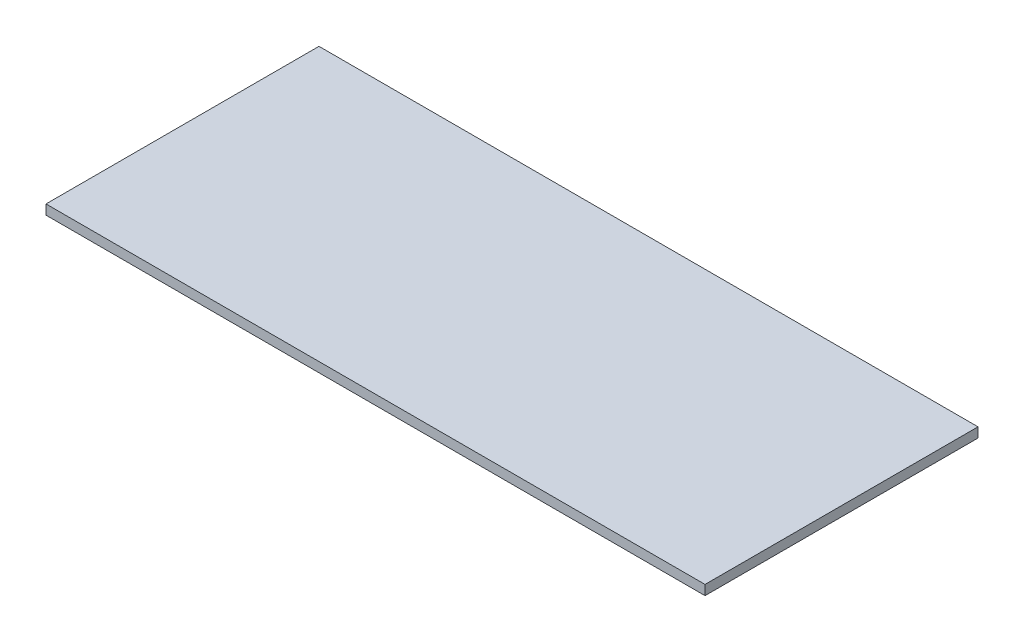
ISO-10303-21;
HEADER;
FILE_DESCRIPTION(('STEP AP214'),'2;1');
FILE_NAME('part.step','',(''),(''),'','','');
FILE_SCHEMA(('AUTOMOTIVE_DESIGN { 1 0 10303 214 1 1 1 1 }'));
ENDSEC;
DATA;
#1=APPLICATION_CONTEXT('core data for automotive mechanical design processes');
#2=APPLICATION_PROTOCOL_DEFINITION('international standard','automotive_design',2000,#1);
#3=PRODUCT_CONTEXT('',#1,'mechanical');
#4=PRODUCT('Part','Part','',(#3));
#5=PRODUCT_RELATED_PRODUCT_CATEGORY('part','',(#4));
#6=PRODUCT_DEFINITION_FORMATION('','',#4);
#7=PRODUCT_DEFINITION_CONTEXT('part definition',#1,'design');
#8=PRODUCT_DEFINITION('design','',#6,#7);
#9=PRODUCT_DEFINITION_SHAPE('','',#8);
#10=(LENGTH_UNIT() NAMED_UNIT(*) SI_UNIT(.MILLI.,.METRE.));
#11=(NAMED_UNIT(*) PLANE_ANGLE_UNIT() SI_UNIT($,.RADIAN.));
#12=(NAMED_UNIT(*) SI_UNIT($,.STERADIAN.) SOLID_ANGLE_UNIT());
#13=UNCERTAINTY_MEASURE_WITH_UNIT(LENGTH_MEASURE(1.E-05),#10,'distance_accuracy_value','');
#14=(GEOMETRIC_REPRESENTATION_CONTEXT(3) GLOBAL_UNCERTAINTY_ASSIGNED_CONTEXT((#13)) GLOBAL_UNIT_ASSIGNED_CONTEXT((#10,
#11,#12)) REPRESENTATION_CONTEXT('',''));
#15=CARTESIAN_POINT('',(0.,0.,0.));
#16=DIRECTION('',(0.,0.,1.));
#17=DIRECTION('',(1.,0.,0.));
#18=AXIS2_PLACEMENT_3D('',#15,#16,#17);
#19=CARTESIAN_POINT('',(0.,6.35,0.));
#20=DIRECTION('',(1.,0.,0.));
#21=DIRECTION('',(0.,0.,-1.));
#22=AXIS2_PLACEMENT_3D('',#19,#20,#21);
#23=PLANE('',#22);
#24=DIRECTION('',(0.,0.,1.));
#25=VECTOR('',#24,1.);
#26=CARTESIAN_POINT('',(0.,0.,0.));
#27=LINE('',#26,#25);
#28=CARTESIAN_POINT('',(0.,0.,-177.8));
#29=VERTEX_POINT('',#28);
#30=CARTESIAN_POINT('',(0.,0.,0.));
#31=VERTEX_POINT('',#30);
#32=EDGE_CURVE('E96',#29,#31,#27,.T.);
#33=ORIENTED_EDGE('',*,*,#32,.T.);
#34=DIRECTION('',(0.,-1.,0.));
#35=VECTOR('',#34,1.);
#36=CARTESIAN_POINT('',(0.,6.35,0.));
#37=LINE('',#36,#35);
#38=CARTESIAN_POINT('',(0.,6.35,0.));
#39=VERTEX_POINT('',#38);
#40=EDGE_CURVE('E11',#39,#31,#37,.T.);
#41=ORIENTED_EDGE('',*,*,#40,.F.);
#42=DIRECTION('',(0.,0.,1.));
#43=VECTOR('',#42,1.);
#44=CARTESIAN_POINT('',(0.,6.35,0.));
#45=LINE('',#44,#43);
#46=CARTESIAN_POINT('',(0.,6.35,-177.8));
#47=VERTEX_POINT('',#46);
#48=EDGE_CURVE('E84',#47,#39,#45,.T.);
#49=ORIENTED_EDGE('',*,*,#48,.F.);
#50=DIRECTION('',(0.,-1.,0.));
#51=VECTOR('',#50,1.);
#52=CARTESIAN_POINT('',(0.,6.35,-177.8));
#53=LINE('',#52,#51);
#54=EDGE_CURVE('E92',#47,#29,#53,.T.);
#55=ORIENTED_EDGE('',*,*,#54,.T.);
#56=EDGE_LOOP('',(#33,#41,#49,#55));
#57=FACE_BOUND('',#56,.T.);
#58=ADVANCED_FACE('F33',(#57),#23,.F.);
#59=CARTESIAN_POINT('',(0.,6.35,0.));
#60=DIRECTION('',(0.,0.,-1.));
#61=DIRECTION('',(-1.,0.,0.));
#62=AXIS2_PLACEMENT_3D('',#59,#60,#61);
#63=PLANE('',#62);
#64=DIRECTION('',(1.,0.,0.));
#65=VECTOR('',#64,1.);
#66=CARTESIAN_POINT('',(0.,0.,0.));
#67=LINE('',#66,#65);
#68=CARTESIAN_POINT('',(429.26,0.,0.));
#69=VERTEX_POINT('',#68);
#70=EDGE_CURVE('E88',#31,#69,#67,.T.);
#71=ORIENTED_EDGE('',*,*,#70,.T.);
#72=DIRECTION('',(0.,-1.,0.));
#73=VECTOR('',#72,1.);
#74=CARTESIAN_POINT('',(429.26,6.35,0.));
#75=LINE('',#74,#73);
#76=CARTESIAN_POINT('',(429.26,6.35,0.));
#77=VERTEX_POINT('',#76);
#78=EDGE_CURVE('E41',#77,#69,#75,.T.);
#79=ORIENTED_EDGE('',*,*,#78,.F.);
#80=DIRECTION('',(1.,0.,0.));
#81=VECTOR('',#80,1.);
#82=CARTESIAN_POINT('',(0.,6.35,0.));
#83=LINE('',#82,#81);
#84=EDGE_CURVE('E79',#39,#77,#83,.T.);
#85=ORIENTED_EDGE('',*,*,#84,.F.);
#86=ORIENTED_EDGE('',*,*,#40,.T.);
#87=EDGE_LOOP('',(#71,#79,#85,#86));
#88=FACE_BOUND('',#87,.T.);
#89=ADVANCED_FACE('F87',(#88),#63,.F.);
#90=CARTESIAN_POINT('',(429.26,6.35,0.));
#91=DIRECTION('',(-1.,0.,0.));
#92=DIRECTION('',(0.,0.,1.));
#93=AXIS2_PLACEMENT_3D('',#90,#91,#92);
#94=PLANE('',#93);
#95=DIRECTION('',(0.,0.,-1.));
#96=VECTOR('',#95,1.);
#97=CARTESIAN_POINT('',(429.26,0.,0.));
#98=LINE('',#97,#96);
#99=CARTESIAN_POINT('',(429.26,0.,-177.8));
#100=VERTEX_POINT('',#99);
#101=EDGE_CURVE('E66',#69,#100,#98,.T.);
#102=ORIENTED_EDGE('',*,*,#101,.T.);
#103=DIRECTION('',(0.,-1.,0.));
#104=VECTOR('',#103,1.);
#105=CARTESIAN_POINT('',(429.26,6.35,-177.8));
#106=LINE('',#105,#104);
#107=CARTESIAN_POINT('',(429.26,6.35,-177.8));
#108=VERTEX_POINT('',#107);
#109=EDGE_CURVE('E89',#108,#100,#106,.T.);
#110=ORIENTED_EDGE('',*,*,#109,.F.);
#111=DIRECTION('',(0.,0.,-1.));
#112=VECTOR('',#111,1.);
#113=CARTESIAN_POINT('',(429.26,6.35,0.));
#114=LINE('',#113,#112);
#115=EDGE_CURVE('E82',#77,#108,#114,.T.);
#116=ORIENTED_EDGE('',*,*,#115,.F.);
#117=ORIENTED_EDGE('',*,*,#78,.T.);
#118=EDGE_LOOP('',(#102,#110,#116,#117));
#119=FACE_BOUND('',#118,.T.);
#120=ADVANCED_FACE('F90',(#119),#94,.F.);
#121=CARTESIAN_POINT('',(0.,6.35,-177.8));
#122=DIRECTION('',(0.,0.,1.));
#123=DIRECTION('',(1.,0.,0.));
#124=AXIS2_PLACEMENT_3D('',#121,#122,#123);
#125=PLANE('',#124);
#126=DIRECTION('',(-1.,0.,0.));
#127=VECTOR('',#126,1.);
#128=CARTESIAN_POINT('',(0.,0.,-177.8));
#129=LINE('',#128,#127);
#130=EDGE_CURVE('E72',#100,#29,#129,.T.);
#131=ORIENTED_EDGE('',*,*,#130,.T.);
#132=ORIENTED_EDGE('',*,*,#54,.F.);
#133=DIRECTION('',(-1.,0.,0.));
#134=VECTOR('',#133,1.);
#135=CARTESIAN_POINT('',(0.,6.35,-177.8));
#136=LINE('',#135,#134);
#137=EDGE_CURVE('E49',#108,#47,#136,.T.);
#138=ORIENTED_EDGE('',*,*,#137,.F.);
#139=ORIENTED_EDGE('',*,*,#109,.T.);
#140=EDGE_LOOP('',(#131,#132,#138,#139));
#141=FACE_BOUND('',#140,.T.);
#142=ADVANCED_FACE('F103',(#141),#125,.F.);
#143=CARTESIAN_POINT('',(0.,6.35,0.));
#144=DIRECTION('',(0.,-1.,0.));
#145=DIRECTION('',(0.,0.,-1.));
#146=AXIS2_PLACEMENT_3D('',#143,#144,#145);
#147=PLANE('',#146);
#148=ORIENTED_EDGE('',*,*,#48,.T.);
#149=ORIENTED_EDGE('',*,*,#84,.T.);
#150=ORIENTED_EDGE('',*,*,#115,.T.);
#151=ORIENTED_EDGE('',*,*,#137,.T.);
#152=EDGE_LOOP('',(#148,#149,#150,#151));
#153=FACE_BOUND('',#152,.T.);
#154=ADVANCED_FACE('F80',(#153),#147,.F.);
#155=CARTESIAN_POINT('',(0.,0.,0.));
#156=DIRECTION('',(0.,-1.,0.));
#157=DIRECTION('',(0.,0.,-1.));
#158=AXIS2_PLACEMENT_3D('',#155,#156,#157);
#159=PLANE('',#158);
#160=ORIENTED_EDGE('',*,*,#32,.F.);
#161=ORIENTED_EDGE('',*,*,#130,.F.);
#162=ORIENTED_EDGE('',*,*,#101,.F.);
#163=ORIENTED_EDGE('',*,*,#70,.F.);
#164=EDGE_LOOP('',(#160,#161,#162,#163));
#165=FACE_BOUND('',#164,.T.);
#166=ADVANCED_FACE('F106',(#165),#159,.T.);
#167=CLOSED_SHELL('',(#58,#89,#120,#142,#154,#166));
#168=MANIFOLD_SOLID_BREP('B2',#167);
#169=ADVANCED_BREP_SHAPE_REPRESENTATION('',(#18,#168),#14);
#170=SHAPE_DEFINITION_REPRESENTATION(#9,#169);
ENDSEC;
END-ISO-10303-21;
